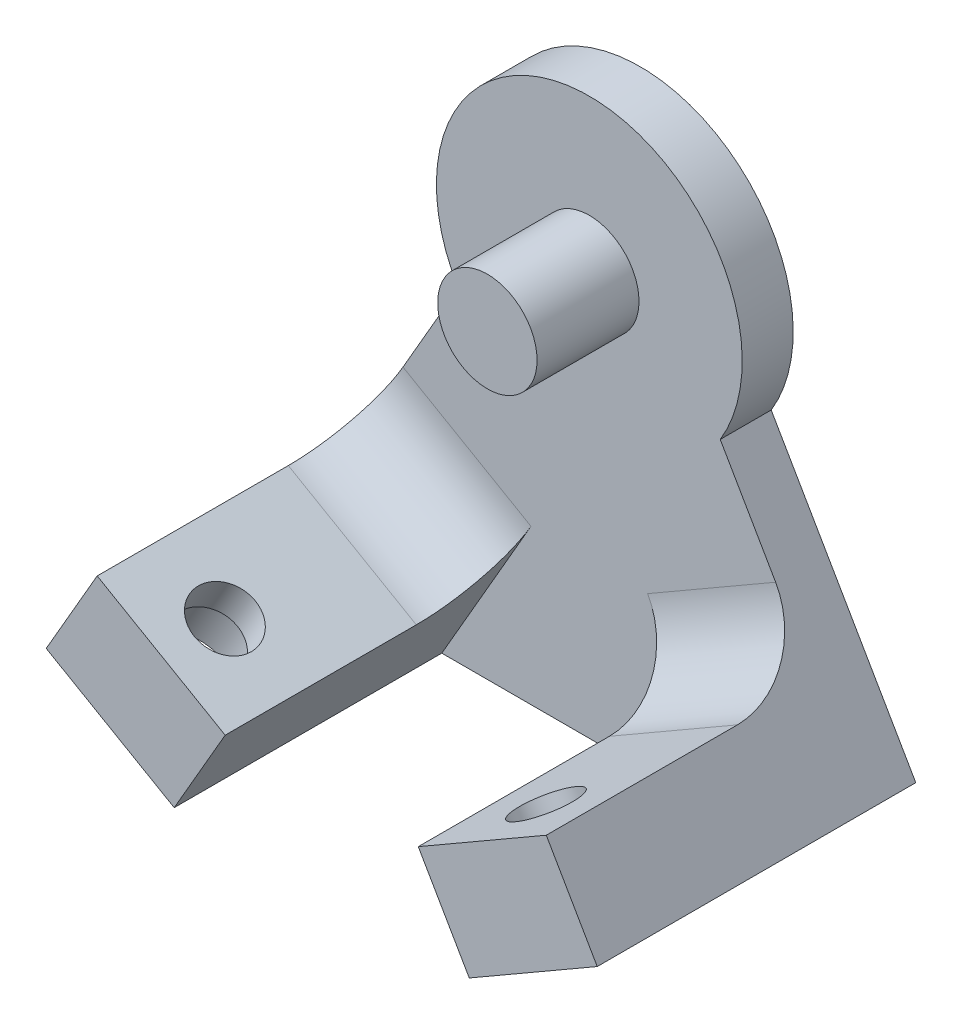
ISO-10303-21;
HEADER;
FILE_DESCRIPTION(('STEP AP214'),'2;1');
FILE_NAME('part.step','',(''),(''),'','','');
FILE_SCHEMA(('AUTOMOTIVE_DESIGN { 1 0 10303 214 1 1 1 1 }'));
ENDSEC;
DATA;
#1=APPLICATION_CONTEXT('core data for automotive mechanical design processes');
#2=APPLICATION_PROTOCOL_DEFINITION('international standard','automotive_design',2000,#1);
#3=PRODUCT_CONTEXT('',#1,'mechanical');
#4=PRODUCT('Part','Part','',(#3));
#5=PRODUCT_RELATED_PRODUCT_CATEGORY('part','',(#4));
#6=PRODUCT_DEFINITION_FORMATION('','',#4);
#7=PRODUCT_DEFINITION_CONTEXT('part definition',#1,'design');
#8=PRODUCT_DEFINITION('design','',#6,#7);
#9=PRODUCT_DEFINITION_SHAPE('','',#8);
#10=(LENGTH_UNIT() NAMED_UNIT(*) SI_UNIT(.MILLI.,.METRE.));
#11=(NAMED_UNIT(*) PLANE_ANGLE_UNIT() SI_UNIT($,.RADIAN.));
#12=(NAMED_UNIT(*) SI_UNIT($,.STERADIAN.) SOLID_ANGLE_UNIT());
#13=UNCERTAINTY_MEASURE_WITH_UNIT(LENGTH_MEASURE(1.E-05),#10,'distance_accuracy_value','');
#14=(GEOMETRIC_REPRESENTATION_CONTEXT(3) GLOBAL_UNCERTAINTY_ASSIGNED_CONTEXT((#13)) GLOBAL_UNIT_ASSIGNED_CONTEXT((#10,
#11,#12)) REPRESENTATION_CONTEXT('',''));
#15=CARTESIAN_POINT('',(0.,0.,0.));
#16=DIRECTION('',(0.,0.,1.));
#17=DIRECTION('',(1.,0.,0.));
#18=AXIS2_PLACEMENT_3D('',#15,#16,#17);
#19=CARTESIAN_POINT('',(-5.30094462909705,9.18150542570543,10.));
#20=DIRECTION('',(0.500000000000001,-0.866025403784438,0.));
#21=DIRECTION('',(0.866025403784438,0.500000000000001,0.));
#22=AXIS2_PLACEMENT_3D('',#19,#20,#21);
#23=CYLINDRICAL_SURFACE('',#22,1.2);
#24=CARTESIAN_POINT('',(6.30000000000001,-10.9119200876839,10.));
#25=DIRECTION('',(0.500000000000001,-0.866025403784438,0.));
#26=DIRECTION('',(0.866025403784438,0.500000000000001,0.));
#27=AXIS2_PLACEMENT_3D('',#24,#25,#26);
#28=CIRCLE('',#27,1.2);
#29=CARTESIAN_POINT('',(7.33923048454134,-10.3119200876839,10.));
#30=VERTEX_POINT('',#29);
#31=EDGE_CURVE('E249',#30,#30,#28,.F.);
#32=ORIENTED_EDGE('',*,*,#31,.T.);
#33=EDGE_LOOP('',(#32));
#34=FACE_BOUND('',#33,.T.);
#35=CARTESIAN_POINT('',(7.00000000000001,-12.1243556529821,10.));
#36=DIRECTION('',(0.500000000000001,-0.866025403784438,0.));
#37=DIRECTION('',(0.866025403784438,0.500000000000001,0.));
#38=AXIS2_PLACEMENT_3D('',#35,#36,#37);
#39=CIRCLE('',#38,1.2);
#40=CARTESIAN_POINT('',(8.03923048454134,-11.5243556529821,10.));
#41=VERTEX_POINT('',#40);
#42=EDGE_CURVE('E37',#41,#41,#39,.T.);
#43=ORIENTED_EDGE('',*,*,#42,.T.);
#44=EDGE_LOOP('',(#43));
#45=FACE_BOUND('',#44,.T.);
#46=ADVANCED_FACE('F33',(#34,#45),#23,.F.);
#47=CARTESIAN_POINT('',(5.30094462909705,9.18150542570543,10.));
#48=DIRECTION('',(-0.500000000000001,-0.866025403784438,0.));
#49=DIRECTION('',(0.866025403784438,-0.500000000000001,0.));
#50=AXIS2_PLACEMENT_3D('',#47,#48,#49);
#51=CYLINDRICAL_SURFACE('',#50,1.2);
#52=CARTESIAN_POINT('',(-6.30000000000001,-10.9119200876839,10.));
#53=DIRECTION('',(-0.500000000000001,-0.866025403784438,0.));
#54=DIRECTION('',(0.866025403784438,-0.500000000000001,0.));
#55=AXIS2_PLACEMENT_3D('',#52,#53,#54);
#56=CIRCLE('',#55,1.2);
#57=CARTESIAN_POINT('',(-5.26076951545868,-11.5119200876839,10.));
#58=VERTEX_POINT('',#57);
#59=EDGE_CURVE('E243',#58,#58,#56,.T.);
#60=ORIENTED_EDGE('',*,*,#59,.F.);
#61=EDGE_LOOP('',(#60));
#62=FACE_BOUND('',#61,.T.);
#63=CARTESIAN_POINT('',(-7.00000000000001,-12.1243556529821,10.));
#64=DIRECTION('',(-0.500000000000001,-0.866025403784438,0.));
#65=DIRECTION('',(0.866025403784438,-0.500000000000001,0.));
#66=AXIS2_PLACEMENT_3D('',#63,#64,#65);
#67=CIRCLE('',#66,1.2);
#68=CARTESIAN_POINT('',(-5.96076951545869,-12.7243556529821,10.));
#69=VERTEX_POINT('',#68);
#70=EDGE_CURVE('E246',#69,#69,#67,.F.);
#71=ORIENTED_EDGE('',*,*,#70,.F.);
#72=EDGE_LOOP('',(#71));
#73=FACE_BOUND('',#72,.T.);
#74=ADVANCED_FACE('F281',(#62,#73),#51,.F.);
#75=CARTESIAN_POINT('',(0.,0.,2.));
#76=DIRECTION('',(0.,0.,1.));
#77=DIRECTION('',(1.,0.,0.));
#78=AXIS2_PLACEMENT_3D('',#75,#76,#77);
#79=PLANE('',#78);
#80=CARTESIAN_POINT('',(0.,0.,2.));
#81=DIRECTION('',(0.,0.,1.));
#82=DIRECTION('',(1.,0.,0.));
#83=AXIS2_PLACEMENT_3D('',#80,#81,#82);
#84=CIRCLE('',#83,1.95);
#85=CARTESIAN_POINT('',(1.95,0.,2.));
#86=VERTEX_POINT('',#85);
#87=EDGE_CURVE('E161',#86,#86,#84,.T.);
#88=ORIENTED_EDGE('',*,*,#87,.F.);
#89=EDGE_LOOP('',(#88));
#90=FACE_BOUND('',#89,.T.);
#91=DIRECTION('',(0.500000000000001,-0.866025403784438,0.));
#92=VECTOR('',#91,1.);
#93=CARTESIAN_POINT('',(5.78852632902514,-15.8260217028217,2.));
#94=LINE('',#93,#92);
#95=CARTESIAN_POINT('',(2.28852632902514,-9.7638438763306,2.));
#96=VERTEX_POINT('',#95);
#97=CARTESIAN_POINT('',(5.78852632902514,-15.8260217028217,2.));
#98=VERTEX_POINT('',#97);
#99=EDGE_CURVE('E156',#96,#98,#94,.T.);
#100=ORIENTED_EDGE('',*,*,#99,.F.);
#101=DIRECTION('',(-0.866025403784438,-0.500000000000001,0.));
#102=VECTOR('',#101,1.);
#103=CARTESIAN_POINT('',(4.80000000000001,-8.3138438763306,2.));
#104=LINE('',#103,#102);
#105=CARTESIAN_POINT('',(7.31147367097488,-6.8638438763306,2.));
#106=VERTEX_POINT('',#105);
#107=EDGE_CURVE('E233',#96,#106,#104,.F.);
#108=ORIENTED_EDGE('',*,*,#107,.T.);
#109=DIRECTION('',(-0.500000000000001,0.866025403784438,0.));
#110=VECTOR('',#109,1.);
#111=CARTESIAN_POINT('',(8.81147367097488,-9.46192008768392,2.));
#112=LINE('',#111,#110);
#113=CARTESIAN_POINT('',(5.13778286830866,-3.09890096616753,2.));
#114=VERTEX_POINT('',#113);
#115=EDGE_CURVE('E203',#106,#114,#112,.T.);
#116=ORIENTED_EDGE('',*,*,#115,.T.);
#117=CARTESIAN_POINT('',(0.,0.,2.));
#118=DIRECTION('',(0.,0.,1.));
#119=DIRECTION('',(1.,0.,0.));
#120=AXIS2_PLACEMENT_3D('',#117,#118,#119);
#121=CIRCLE('',#120,6.);
#122=CARTESIAN_POINT('',(-5.13778286830866,-3.09890096616753,2.));
#123=VERTEX_POINT('',#122);
#124=EDGE_CURVE('E193',#114,#123,#121,.T.);
#125=ORIENTED_EDGE('',*,*,#124,.T.);
#126=DIRECTION('',(-0.5,-0.866025403784438,0.));
#127=VECTOR('',#126,1.);
#128=CARTESIAN_POINT('',(-8.81147367097488,-9.46192008768392,2.));
#129=LINE('',#128,#127);
#130=CARTESIAN_POINT('',(-7.31147367097488,-6.8638438763306,2.));
#131=VERTEX_POINT('',#130);
#132=EDGE_CURVE('E196',#123,#131,#129,.T.);
#133=ORIENTED_EDGE('',*,*,#132,.T.);
#134=DIRECTION('',(-0.866025403784438,0.500000000000001,0.));
#135=VECTOR('',#134,1.);
#136=CARTESIAN_POINT('',(-4.80000000000001,-8.31384387633061,2.));
#137=LINE('',#136,#135);
#138=CARTESIAN_POINT('',(-2.28852632902514,-9.7638438763306,2.));
#139=VERTEX_POINT('',#138);
#140=EDGE_CURVE('E230',#131,#139,#137,.F.);
#141=ORIENTED_EDGE('',*,*,#140,.T.);
#142=DIRECTION('',(0.500000000000001,0.866025403784438,0.));
#143=VECTOR('',#142,1.);
#144=CARTESIAN_POINT('',(-5.78852632902514,-15.8260217028217,2.));
#145=LINE('',#144,#143);
#146=CARTESIAN_POINT('',(-5.78852632902514,-15.8260217028217,2.));
#147=VERTEX_POINT('',#146);
#148=EDGE_CURVE('E172',#147,#139,#145,.T.);
#149=ORIENTED_EDGE('',*,*,#148,.F.);
#150=DIRECTION('',(1.,0.,0.));
#151=VECTOR('',#150,1.);
#152=CARTESIAN_POINT('',(-5.78852632902514,-15.8260217028217,2.));
#153=LINE('',#152,#151);
#154=EDGE_CURVE('E200',#147,#98,#153,.T.);
#155=ORIENTED_EDGE('',*,*,#154,.T.);
#156=EDGE_LOOP('',(#100,#108,#116,#125,#133,#141,#149,#155));
#157=FACE_BOUND('',#156,.T.);
#158=ADVANCED_FACE('F277',(#90,#157),#79,.T.);
#159=CARTESIAN_POINT('',(0.,0.,2.));
#160=DIRECTION('',(0.,0.,-1.));
#161=DIRECTION('',(-1.,0.,0.));
#162=AXIS2_PLACEMENT_3D('',#159,#160,#161);
#163=CYLINDRICAL_SURFACE('',#162,6.);
#164=CARTESIAN_POINT('',(0.,0.,0.));
#165=DIRECTION('',(0.,0.,1.));
#166=DIRECTION('',(1.,0.,0.));
#167=AXIS2_PLACEMENT_3D('',#164,#165,#166);
#168=CIRCLE('',#167,6.);
#169=CARTESIAN_POINT('',(5.13778286830866,-3.09890096616753,0.));
#170=VERTEX_POINT('',#169);
#171=CARTESIAN_POINT('',(-5.13778286830866,-3.09890096616753,0.));
#172=VERTEX_POINT('',#171);
#173=EDGE_CURVE('E192',#170,#172,#168,.T.);
#174=ORIENTED_EDGE('',*,*,#173,.T.);
#175=DIRECTION('',(0.,0.,-1.));
#176=VECTOR('',#175,1.);
#177=CARTESIAN_POINT('',(-5.13778286830866,-3.09890096616753,2.));
#178=LINE('',#177,#176);
#179=EDGE_CURVE('E224',#123,#172,#178,.T.);
#180=ORIENTED_EDGE('',*,*,#179,.F.);
#181=ORIENTED_EDGE('',*,*,#124,.F.);
#182=DIRECTION('',(0.,0.,-1.));
#183=VECTOR('',#182,1.);
#184=CARTESIAN_POINT('',(5.13778286830866,-3.09890096616753,2.));
#185=LINE('',#184,#183);
#186=EDGE_CURVE('E141',#114,#170,#185,.T.);
#187=ORIENTED_EDGE('',*,*,#186,.T.);
#188=EDGE_LOOP('',(#174,#180,#181,#187));
#189=FACE_BOUND('',#188,.T.);
#190=ADVANCED_FACE('F280',(#189),#163,.T.);
#191=CARTESIAN_POINT('',(-8.81147367097488,-9.46192008768392,2.));
#192=DIRECTION('',(0.866025403784438,-0.500000000000001,0.));
#193=DIRECTION('',(0.500000000000001,0.866025403784438,0.));
#194=AXIS2_PLACEMENT_3D('',#191,#192,#193);
#195=PLANE('',#194);
#196=DIRECTION('',(-0.500000000000001,-0.866025403784438,0.));
#197=VECTOR('',#196,1.);
#198=CARTESIAN_POINT('',(-8.81147367097488,-9.46192008768392,0.));
#199=LINE('',#198,#197);
#200=CARTESIAN_POINT('',(-10.8114736709749,-12.9260217028217,0.));
#201=VERTEX_POINT('',#200);
#202=EDGE_CURVE('E207',#172,#201,#199,.T.);
#203=ORIENTED_EDGE('',*,*,#202,.T.);
#204=DIRECTION('',(0.,0.,-1.));
#205=VECTOR('',#204,1.);
#206=CARTESIAN_POINT('',(-10.8114736709749,-12.9260217028217,2.));
#207=LINE('',#206,#205);
#208=CARTESIAN_POINT('',(-10.8114736709749,-12.9260217028217,12.5));
#209=VERTEX_POINT('',#208);
#210=EDGE_CURVE('E221',#209,#201,#207,.T.);
#211=ORIENTED_EDGE('',*,*,#210,.F.);
#212=DIRECTION('',(-0.500000000000001,-0.866025403784438,0.));
#213=VECTOR('',#212,1.);
#214=CARTESIAN_POINT('',(-10.8114736709749,-12.9260217028217,12.5));
#215=LINE('',#214,#213);
#216=CARTESIAN_POINT('',(-8.81147367097488,-9.46192008768392,12.5));
#217=VERTEX_POINT('',#216);
#218=EDGE_CURVE('E178',#217,#209,#215,.T.);
#219=ORIENTED_EDGE('',*,*,#218,.F.);
#220=DIRECTION('',(0.,0.,-1.));
#221=VECTOR('',#220,1.);
#222=CARTESIAN_POINT('',(-8.81147367097488,-9.46192008768392,12.5));
#223=LINE('',#222,#221);
#224=CARTESIAN_POINT('',(-8.81147367097488,-9.46192008768392,5.));
#225=VERTEX_POINT('',#224);
#226=EDGE_CURVE('E187',#217,#225,#223,.T.);
#227=ORIENTED_EDGE('',*,*,#226,.T.);
#228=CARTESIAN_POINT('',(-7.31147367097488,-6.8638438763306,5.));
#229=DIRECTION('',(0.866025403784438,-0.500000000000001,0.));
#230=DIRECTION('',(0.500000000000001,0.866025403784438,0.));
#231=AXIS2_PLACEMENT_3D('',#228,#229,#230);
#232=CIRCLE('',#231,3.);
#233=EDGE_CURVE('E42',#225,#131,#232,.T.);
#234=ORIENTED_EDGE('',*,*,#233,.T.);
#235=ORIENTED_EDGE('',*,*,#132,.F.);
#236=ORIENTED_EDGE('',*,*,#179,.T.);
#237=EDGE_LOOP('',(#203,#211,#219,#227,#234,#235,#236));
#238=FACE_BOUND('',#237,.T.);
#239=ADVANCED_FACE('F311',(#238),#195,.F.);
#240=CARTESIAN_POINT('',(-10.8114736709749,-12.9260217028217,2.));
#241=DIRECTION('',(0.500000000000001,0.866025403784438,0.));
#242=DIRECTION('',(-0.866025403784438,0.500000000000001,0.));
#243=AXIS2_PLACEMENT_3D('',#240,#241,#242);
#244=PLANE('',#243);
#245=CARTESIAN_POINT('',(-8.30000000000001,-14.3760217028217,10.));
#246=DIRECTION('',(-0.500000000000001,-0.866025403784438,0.));
#247=DIRECTION('',(0.866025403784438,-0.500000000000001,0.));
#248=AXIS2_PLACEMENT_3D('',#245,#246,#247);
#249=CIRCLE('',#248,2.);
#250=CARTESIAN_POINT('',(-6.56794919243114,-15.3760217028217,10.));
#251=VERTEX_POINT('',#250);
#252=EDGE_CURVE('E251',#251,#251,#249,.T.);
#253=ORIENTED_EDGE('',*,*,#252,.F.);
#254=EDGE_LOOP('',(#253));
#255=FACE_BOUND('',#254,.T.);
#256=DIRECTION('',(0.866025403784438,-0.500000000000001,0.));
#257=VECTOR('',#256,1.);
#258=CARTESIAN_POINT('',(-10.8114736709749,-12.9260217028217,0.));
#259=LINE('',#258,#257);
#260=CARTESIAN_POINT('',(-5.78852632902514,-15.8260217028217,0.));
#261=VERTEX_POINT('',#260);
#262=EDGE_CURVE('E209',#201,#261,#259,.T.);
#263=ORIENTED_EDGE('',*,*,#262,.T.);
#264=DIRECTION('',(0.,0.,-1.));
#265=VECTOR('',#264,1.);
#266=CARTESIAN_POINT('',(-5.78852632902514,-15.8260217028217,2.));
#267=LINE('',#266,#265);
#268=EDGE_CURVE('E218',#147,#261,#267,.T.);
#269=ORIENTED_EDGE('',*,*,#268,.F.);
#270=DIRECTION('',(0.,0.,-1.));
#271=VECTOR('',#270,1.);
#272=CARTESIAN_POINT('',(-5.78852632902514,-15.8260217028217,12.5));
#273=LINE('',#272,#271);
#274=CARTESIAN_POINT('',(-5.78852632902514,-15.8260217028217,12.5));
#275=VERTEX_POINT('',#274);
#276=EDGE_CURVE('E183',#275,#147,#273,.T.);
#277=ORIENTED_EDGE('',*,*,#276,.F.);
#278=DIRECTION('',(0.866025403784438,-0.500000000000001,0.));
#279=VECTOR('',#278,1.);
#280=CARTESIAN_POINT('',(-5.78852632902514,-15.8260217028217,12.5));
#281=LINE('',#280,#279);
#282=EDGE_CURVE('E181',#209,#275,#281,.T.);
#283=ORIENTED_EDGE('',*,*,#282,.F.);
#284=ORIENTED_EDGE('',*,*,#210,.T.);
#285=EDGE_LOOP('',(#263,#269,#277,#283,#284));
#286=FACE_BOUND('',#285,.T.);
#287=ADVANCED_FACE('F317',(#255,#286),#244,.F.);
#288=CARTESIAN_POINT('',(-5.78852632902514,-15.8260217028217,2.));
#289=DIRECTION('',(0.,1.,0.));
#290=DIRECTION('',(0.,0.,1.));
#291=AXIS2_PLACEMENT_3D('',#288,#289,#290);
#292=PLANE('',#291);
#293=DIRECTION('',(1.,0.,0.));
#294=VECTOR('',#293,1.);
#295=CARTESIAN_POINT('',(-5.78852632902514,-15.8260217028217,0.));
#296=LINE('',#295,#294);
#297=CARTESIAN_POINT('',(5.78852632902514,-15.8260217028217,0.));
#298=VERTEX_POINT('',#297);
#299=EDGE_CURVE('E211',#261,#298,#296,.T.);
#300=ORIENTED_EDGE('',*,*,#299,.T.);
#301=DIRECTION('',(0.,0.,-1.));
#302=VECTOR('',#301,1.);
#303=CARTESIAN_POINT('',(5.78852632902514,-15.8260217028217,2.));
#304=LINE('',#303,#302);
#305=EDGE_CURVE('E140',#98,#298,#304,.T.);
#306=ORIENTED_EDGE('',*,*,#305,.F.);
#307=ORIENTED_EDGE('',*,*,#154,.F.);
#308=ORIENTED_EDGE('',*,*,#268,.T.);
#309=EDGE_LOOP('',(#300,#306,#307,#308));
#310=FACE_BOUND('',#309,.T.);
#311=ADVANCED_FACE('F483',(#310),#292,.F.);
#312=CARTESIAN_POINT('',(10.8114736709749,-12.9260217028217,2.));
#313=DIRECTION('',(-0.500000000000001,0.866025403784438,0.));
#314=DIRECTION('',(-0.866025403784438,-0.500000000000001,0.));
#315=AXIS2_PLACEMENT_3D('',#312,#313,#314);
#316=PLANE('',#315);
#317=CARTESIAN_POINT('',(8.30000000000001,-14.3760217028217,10.));
#318=DIRECTION('',(-0.500000000000001,0.866025403784438,0.));
#319=DIRECTION('',(-0.866025403784438,-0.500000000000001,0.));
#320=AXIS2_PLACEMENT_3D('',#317,#318,#319);
#321=CIRCLE('',#320,2.);
#322=CARTESIAN_POINT('',(6.56794919243114,-15.3760217028217,10.));
#323=VERTEX_POINT('',#322);
#324=EDGE_CURVE('E261',#323,#323,#321,.T.);
#325=ORIENTED_EDGE('',*,*,#324,.T.);
#326=EDGE_LOOP('',(#325));
#327=FACE_BOUND('',#326,.T.);
#328=DIRECTION('',(0.866025403784438,0.500000000000001,0.));
#329=VECTOR('',#328,1.);
#330=CARTESIAN_POINT('',(10.8114736709749,-12.9260217028217,0.));
#331=LINE('',#330,#329);
#332=CARTESIAN_POINT('',(10.8114736709749,-12.9260217028217,0.));
#333=VERTEX_POINT('',#332);
#334=EDGE_CURVE('E138',#298,#333,#331,.T.);
#335=ORIENTED_EDGE('',*,*,#334,.T.);
#336=DIRECTION('',(0.,0.,-1.));
#337=VECTOR('',#336,1.);
#338=CARTESIAN_POINT('',(10.8114736709749,-12.9260217028217,2.));
#339=LINE('',#338,#337);
#340=CARTESIAN_POINT('',(10.8114736709749,-12.9260217028217,12.5));
#341=VERTEX_POINT('',#340);
#342=EDGE_CURVE('E130',#341,#333,#339,.T.);
#343=ORIENTED_EDGE('',*,*,#342,.F.);
#344=DIRECTION('',(0.866025403784438,0.500000000000001,0.));
#345=VECTOR('',#344,1.);
#346=CARTESIAN_POINT('',(5.78852632902514,-15.8260217028217,12.5));
#347=LINE('',#346,#345);
#348=CARTESIAN_POINT('',(5.78852632902514,-15.8260217028217,12.5));
#349=VERTEX_POINT('',#348);
#350=EDGE_CURVE('E135',#349,#341,#347,.T.);
#351=ORIENTED_EDGE('',*,*,#350,.F.);
#352=DIRECTION('',(0.,0.,-1.));
#353=VECTOR('',#352,1.);
#354=CARTESIAN_POINT('',(5.78852632902514,-15.8260217028217,12.5));
#355=LINE('',#354,#353);
#356=EDGE_CURVE('E165',#349,#98,#355,.T.);
#357=ORIENTED_EDGE('',*,*,#356,.T.);
#358=ORIENTED_EDGE('',*,*,#305,.T.);
#359=EDGE_LOOP('',(#335,#343,#351,#357,#358));
#360=FACE_BOUND('',#359,.T.);
#361=ADVANCED_FACE('F132',(#327,#360),#316,.F.);
#362=CARTESIAN_POINT('',(8.81147367097488,-9.46192008768392,2.));
#363=DIRECTION('',(-0.866025403784438,-0.5,0.));
#364=DIRECTION('',(0.5,-0.866025403784438,0.));
#365=AXIS2_PLACEMENT_3D('',#362,#363,#364);
#366=PLANE('',#365);
#367=DIRECTION('',(-0.5,0.866025403784438,0.));
#368=VECTOR('',#367,1.);
#369=CARTESIAN_POINT('',(8.81147367097488,-9.46192008768392,0.));
#370=LINE('',#369,#368);
#371=EDGE_CURVE('E197',#333,#170,#370,.T.);
#372=ORIENTED_EDGE('',*,*,#371,.T.);
#373=ORIENTED_EDGE('',*,*,#186,.F.);
#374=ORIENTED_EDGE('',*,*,#115,.F.);
#375=CARTESIAN_POINT('',(7.31147367097488,-6.8638438763306,5.));
#376=DIRECTION('',(-0.866025403784438,-0.5,0.));
#377=DIRECTION('',(0.5,-0.866025403784438,0.));
#378=AXIS2_PLACEMENT_3D('',#375,#376,#377);
#379=CIRCLE('',#378,3.);
#380=CARTESIAN_POINT('',(8.81147367097488,-9.46192008768392,5.));
#381=VERTEX_POINT('',#380);
#382=EDGE_CURVE('E240',#106,#381,#379,.T.);
#383=ORIENTED_EDGE('',*,*,#382,.T.);
#384=DIRECTION('',(0.,0.,-1.));
#385=VECTOR('',#384,1.);
#386=CARTESIAN_POINT('',(8.81147367097488,-9.46192008768392,12.5));
#387=LINE('',#386,#385);
#388=CARTESIAN_POINT('',(8.81147367097488,-9.46192008768392,12.5));
#389=VERTEX_POINT('',#388);
#390=EDGE_CURVE('E147',#389,#381,#387,.T.);
#391=ORIENTED_EDGE('',*,*,#390,.F.);
#392=DIRECTION('',(-0.500000000000001,0.866025403784438,0.));
#393=VECTOR('',#392,1.);
#394=CARTESIAN_POINT('',(10.8114736709749,-12.9260217028217,12.5));
#395=LINE('',#394,#393);
#396=EDGE_CURVE('E144',#341,#389,#395,.T.);
#397=ORIENTED_EDGE('',*,*,#396,.F.);
#398=ORIENTED_EDGE('',*,*,#342,.T.);
#399=EDGE_LOOP('',(#372,#373,#374,#383,#391,#397,#398));
#400=FACE_BOUND('',#399,.T.);
#401=ADVANCED_FACE('F145',(#400),#366,.F.);
#402=CARTESIAN_POINT('',(0.,0.,0.));
#403=DIRECTION('',(0.,0.,1.));
#404=DIRECTION('',(1.,0.,0.));
#405=AXIS2_PLACEMENT_3D('',#402,#403,#404);
#406=PLANE('',#405);
#407=ORIENTED_EDGE('',*,*,#173,.F.);
#408=ORIENTED_EDGE('',*,*,#371,.F.);
#409=ORIENTED_EDGE('',*,*,#334,.F.);
#410=ORIENTED_EDGE('',*,*,#299,.F.);
#411=ORIENTED_EDGE('',*,*,#262,.F.);
#412=ORIENTED_EDGE('',*,*,#202,.F.);
#413=EDGE_LOOP('',(#407,#408,#409,#410,#411,#412));
#414=FACE_BOUND('',#413,.T.);
#415=ADVANCED_FACE('F301',(#414),#406,.F.);
#416=CARTESIAN_POINT('',(-5.78852632902514,-15.8260217028217,12.5));
#417=DIRECTION('',(-0.866025403784438,0.500000000000001,0.));
#418=DIRECTION('',(-0.500000000000001,-0.866025403784438,0.));
#419=AXIS2_PLACEMENT_3D('',#416,#417,#418);
#420=PLANE('',#419);
#421=ORIENTED_EDGE('',*,*,#148,.T.);
#422=CARTESIAN_POINT('',(-2.28852632902514,-9.7638438763306,5.));
#423=DIRECTION('',(-0.866025403784438,0.500000000000001,0.));
#424=DIRECTION('',(-0.500000000000001,-0.866025403784438,0.));
#425=AXIS2_PLACEMENT_3D('',#422,#423,#424);
#426=CIRCLE('',#425,3.);
#427=CARTESIAN_POINT('',(-3.78852632902514,-12.3619200876839,5.));
#428=VERTEX_POINT('',#427);
#429=EDGE_CURVE('E11',#139,#428,#426,.T.);
#430=ORIENTED_EDGE('',*,*,#429,.T.);
#431=DIRECTION('',(0.,0.,-1.));
#432=VECTOR('',#431,1.);
#433=CARTESIAN_POINT('',(-3.78852632902514,-12.3619200876839,12.5));
#434=LINE('',#433,#432);
#435=CARTESIAN_POINT('',(-3.78852632902514,-12.3619200876839,12.5));
#436=VERTEX_POINT('',#435);
#437=EDGE_CURVE('E190',#436,#428,#434,.T.);
#438=ORIENTED_EDGE('',*,*,#437,.F.);
#439=DIRECTION('',(0.500000000000001,0.866025403784438,0.));
#440=VECTOR('',#439,1.);
#441=CARTESIAN_POINT('',(-5.78852632902514,-15.8260217028217,12.5));
#442=LINE('',#441,#440);
#443=EDGE_CURVE('E173',#275,#436,#442,.T.);
#444=ORIENTED_EDGE('',*,*,#443,.F.);
#445=ORIENTED_EDGE('',*,*,#276,.T.);
#446=EDGE_LOOP('',(#421,#430,#438,#444,#445));
#447=FACE_BOUND('',#446,.T.);
#448=ADVANCED_FACE('F320',(#447),#420,.F.);
#449=CARTESIAN_POINT('',(-3.78852632902514,-12.3619200876839,12.5));
#450=DIRECTION('',(-0.500000000000001,-0.866025403784438,0.));
#451=DIRECTION('',(0.866025403784438,-0.500000000000001,0.));
#452=AXIS2_PLACEMENT_3D('',#449,#450,#451);
#453=PLANE('',#452);
#454=ORIENTED_EDGE('',*,*,#59,.T.);
#455=EDGE_LOOP('',(#454));
#456=FACE_BOUND('',#455,.T.);
#457=ORIENTED_EDGE('',*,*,#437,.T.);
#458=DIRECTION('',(-0.866025403784438,0.500000000000001,0.));
#459=VECTOR('',#458,1.);
#460=CARTESIAN_POINT('',(-3.78852632902514,-12.3619200876839,5.));
#461=LINE('',#460,#459);
#462=EDGE_CURVE('E235',#428,#225,#461,.T.);
#463=ORIENTED_EDGE('',*,*,#462,.T.);
#464=ORIENTED_EDGE('',*,*,#226,.F.);
#465=DIRECTION('',(-0.866025403784438,0.500000000000001,0.));
#466=VECTOR('',#465,1.);
#467=CARTESIAN_POINT('',(-3.78852632902514,-12.3619200876839,12.5));
#468=LINE('',#467,#466);
#469=EDGE_CURVE('E176',#436,#217,#468,.T.);
#470=ORIENTED_EDGE('',*,*,#469,.F.);
#471=EDGE_LOOP('',(#457,#463,#464,#470));
#472=FACE_BOUND('',#471,.T.);
#473=ADVANCED_FACE('F309',(#456,#472),#453,.F.);
#474=CARTESIAN_POINT('',(0.,0.,12.5));
#475=DIRECTION('',(0.,0.,1.));
#476=DIRECTION('',(1.,0.,0.));
#477=AXIS2_PLACEMENT_3D('',#474,#475,#476);
#478=PLANE('',#477);
#479=ORIENTED_EDGE('',*,*,#443,.T.);
#480=ORIENTED_EDGE('',*,*,#469,.T.);
#481=ORIENTED_EDGE('',*,*,#218,.T.);
#482=ORIENTED_EDGE('',*,*,#282,.T.);
#483=EDGE_LOOP('',(#479,#480,#481,#482));
#484=FACE_BOUND('',#483,.T.);
#485=ADVANCED_FACE('F314',(#484),#478,.T.);
#486=CARTESIAN_POINT('',(3.78852632902514,-12.3619200876839,12.5));
#487=DIRECTION('',(0.500000000000001,-0.866025403784438,0.));
#488=DIRECTION('',(0.866025403784438,0.500000000000001,0.));
#489=AXIS2_PLACEMENT_3D('',#486,#487,#488);
#490=PLANE('',#489);
#491=ORIENTED_EDGE('',*,*,#31,.F.);
#492=EDGE_LOOP('',(#491));
#493=FACE_BOUND('',#492,.T.);
#494=ORIENTED_EDGE('',*,*,#390,.T.);
#495=DIRECTION('',(-0.866025403784438,-0.500000000000001,0.));
#496=VECTOR('',#495,1.);
#497=CARTESIAN_POINT('',(3.78852632902514,-12.3619200876839,5.));
#498=LINE('',#497,#496);
#499=CARTESIAN_POINT('',(3.78852632902514,-12.3619200876839,5.));
#500=VERTEX_POINT('',#499);
#501=EDGE_CURVE('E227',#381,#500,#498,.T.);
#502=ORIENTED_EDGE('',*,*,#501,.T.);
#503=DIRECTION('',(0.,0.,-1.));
#504=VECTOR('',#503,1.);
#505=CARTESIAN_POINT('',(3.78852632902514,-12.3619200876839,12.5));
#506=LINE('',#505,#504);
#507=CARTESIAN_POINT('',(3.78852632902514,-12.3619200876839,12.5));
#508=VERTEX_POINT('',#507);
#509=EDGE_CURVE('E168',#508,#500,#506,.T.);
#510=ORIENTED_EDGE('',*,*,#509,.F.);
#511=DIRECTION('',(-0.866025403784438,-0.500000000000001,0.));
#512=VECTOR('',#511,1.);
#513=CARTESIAN_POINT('',(3.78852632902514,-12.3619200876839,12.5));
#514=LINE('',#513,#512);
#515=EDGE_CURVE('E150',#389,#508,#514,.T.);
#516=ORIENTED_EDGE('',*,*,#515,.F.);
#517=EDGE_LOOP('',(#494,#502,#510,#516));
#518=FACE_BOUND('',#517,.T.);
#519=ADVANCED_FACE('F296',(#493,#518),#490,.F.);
#520=CARTESIAN_POINT('',(5.78852632902514,-15.8260217028217,12.5));
#521=DIRECTION('',(0.866025403784438,0.500000000000001,0.));
#522=DIRECTION('',(-0.500000000000001,0.866025403784438,0.));
#523=AXIS2_PLACEMENT_3D('',#520,#521,#522);
#524=PLANE('',#523);
#525=ORIENTED_EDGE('',*,*,#99,.T.);
#526=ORIENTED_EDGE('',*,*,#356,.F.);
#527=DIRECTION('',(0.500000000000001,-0.866025403784438,0.));
#528=VECTOR('',#527,1.);
#529=CARTESIAN_POINT('',(5.78852632902514,-15.8260217028217,12.5));
#530=LINE('',#529,#528);
#531=EDGE_CURVE('E154',#508,#349,#530,.T.);
#532=ORIENTED_EDGE('',*,*,#531,.F.);
#533=ORIENTED_EDGE('',*,*,#509,.T.);
#534=CARTESIAN_POINT('',(2.28852632902514,-9.7638438763306,5.));
#535=DIRECTION('',(0.866025403784438,0.500000000000001,0.));
#536=DIRECTION('',(-0.500000000000001,0.866025403784438,0.));
#537=AXIS2_PLACEMENT_3D('',#534,#535,#536);
#538=CIRCLE('',#537,3.);
#539=EDGE_CURVE('E237',#500,#96,#538,.T.);
#540=ORIENTED_EDGE('',*,*,#539,.T.);
#541=EDGE_LOOP('',(#525,#526,#532,#533,#540));
#542=FACE_BOUND('',#541,.T.);
#543=ADVANCED_FACE('F288',(#542),#524,.F.);
#544=CARTESIAN_POINT('',(0.,0.,12.5));
#545=DIRECTION('',(0.,0.,1.));
#546=DIRECTION('',(1.,0.,0.));
#547=AXIS2_PLACEMENT_3D('',#544,#545,#546);
#548=PLANE('',#547);
#549=ORIENTED_EDGE('',*,*,#350,.T.);
#550=ORIENTED_EDGE('',*,*,#396,.T.);
#551=ORIENTED_EDGE('',*,*,#515,.T.);
#552=ORIENTED_EDGE('',*,*,#531,.T.);
#553=EDGE_LOOP('',(#549,#550,#551,#552));
#554=FACE_BOUND('',#553,.T.);
#555=ADVANCED_FACE('F152',(#554),#548,.T.);
#556=CARTESIAN_POINT('',(0.,0.,6.));
#557=DIRECTION('',(0.,0.,-1.));
#558=DIRECTION('',(-1.,0.,0.));
#559=AXIS2_PLACEMENT_3D('',#556,#557,#558);
#560=CYLINDRICAL_SURFACE('',#559,1.95);
#561=CARTESIAN_POINT('',(0.,0.,6.));
#562=DIRECTION('',(0.,0.,1.));
#563=DIRECTION('',(1.,0.,0.));
#564=AXIS2_PLACEMENT_3D('',#561,#562,#563);
#565=CIRCLE('',#564,1.95);
#566=CARTESIAN_POINT('',(1.95,0.,6.));
#567=VERTEX_POINT('',#566);
#568=EDGE_CURVE('E158',#567,#567,#565,.T.);
#569=ORIENTED_EDGE('',*,*,#568,.F.);
#570=EDGE_LOOP('',(#569));
#571=FACE_BOUND('',#570,.T.);
#572=ORIENTED_EDGE('',*,*,#87,.T.);
#573=EDGE_LOOP('',(#572));
#574=FACE_BOUND('',#573,.T.);
#575=ADVANCED_FACE('F275',(#571,#574),#560,.T.);
#576=CARTESIAN_POINT('',(0.,0.,6.));
#577=DIRECTION('',(0.,0.,1.));
#578=DIRECTION('',(1.,0.,0.));
#579=AXIS2_PLACEMENT_3D('',#576,#577,#578);
#580=PLANE('',#579);
#581=ORIENTED_EDGE('',*,*,#568,.T.);
#582=EDGE_LOOP('',(#581));
#583=FACE_BOUND('',#582,.T.);
#584=ADVANCED_FACE('F349',(#583),#580,.T.);
#585=CARTESIAN_POINT('',(2.28852632902514,-9.7638438763306,5.));
#586=DIRECTION('',(-0.866025403784438,-0.500000000000001,0.));
#587=DIRECTION('',(0.500000000000001,-0.866025403784438,0.));
#588=AXIS2_PLACEMENT_3D('',#585,#586,#587);
#589=CYLINDRICAL_SURFACE('',#588,3.);
#590=ORIENTED_EDGE('',*,*,#382,.F.);
#591=ORIENTED_EDGE('',*,*,#107,.F.);
#592=ORIENTED_EDGE('',*,*,#539,.F.);
#593=ORIENTED_EDGE('',*,*,#501,.F.);
#594=EDGE_LOOP('',(#590,#591,#592,#593));
#595=FACE_BOUND('',#594,.T.);
#596=ADVANCED_FACE('F293',(#595),#589,.F.);
#597=CARTESIAN_POINT('',(-2.28852632902514,-9.7638438763306,5.));
#598=DIRECTION('',(-0.866025403784438,0.500000000000001,0.));
#599=DIRECTION('',(-0.500000000000001,-0.866025403784438,0.));
#600=AXIS2_PLACEMENT_3D('',#597,#598,#599);
#601=CYLINDRICAL_SURFACE('',#600,3.);
#602=ORIENTED_EDGE('',*,*,#429,.F.);
#603=ORIENTED_EDGE('',*,*,#140,.F.);
#604=ORIENTED_EDGE('',*,*,#233,.F.);
#605=ORIENTED_EDGE('',*,*,#462,.F.);
#606=EDGE_LOOP('',(#602,#603,#604,#605));
#607=FACE_BOUND('',#606,.T.);
#608=ADVANCED_FACE('F35',(#607),#601,.F.);
#609=CARTESIAN_POINT('',(-7.00000000000001,-12.1243556529821,10.));
#610=DIRECTION('',(-0.500000000000001,-0.866025403784438,0.));
#611=DIRECTION('',(0.866025403784438,-0.500000000000001,0.));
#612=AXIS2_PLACEMENT_3D('',#609,#610,#611);
#613=PLANE('',#612);
#614=CARTESIAN_POINT('',(-7.00000000000001,-12.1243556529821,10.));
#615=DIRECTION('',(-0.500000000000001,-0.866025403784438,0.));
#616=DIRECTION('',(0.866025403784438,-0.500000000000001,0.));
#617=AXIS2_PLACEMENT_3D('',#614,#615,#616);
#618=CIRCLE('',#617,2.);
#619=CARTESIAN_POINT('',(-5.26794919243113,-13.1243556529821,10.));
#620=VERTEX_POINT('',#619);
#621=EDGE_CURVE('E248',#620,#620,#618,.T.);
#622=ORIENTED_EDGE('',*,*,#621,.T.);
#623=EDGE_LOOP('',(#622));
#624=FACE_BOUND('',#623,.T.);
#625=ORIENTED_EDGE('',*,*,#70,.T.);
#626=EDGE_LOOP('',(#625));
#627=FACE_BOUND('',#626,.T.);
#628=ADVANCED_FACE('F341',(#624,#627),#613,.T.);
#629=CARTESIAN_POINT('',(-7.00000000000001,-12.1243556529821,10.));
#630=DIRECTION('',(-0.500000000000001,-0.866025403784438,0.));
#631=DIRECTION('',(0.866025403784438,-0.500000000000001,0.));
#632=AXIS2_PLACEMENT_3D('',#629,#630,#631);
#633=CYLINDRICAL_SURFACE('',#632,2.);
#634=ORIENTED_EDGE('',*,*,#621,.F.);
#635=EDGE_LOOP('',(#634));
#636=FACE_BOUND('',#635,.T.);
#637=ORIENTED_EDGE('',*,*,#252,.T.);
#638=EDGE_LOOP('',(#637));
#639=FACE_BOUND('',#638,.T.);
#640=ADVANCED_FACE('F344',(#636,#639),#633,.F.);
#641=CARTESIAN_POINT('',(7.00000000000001,-12.1243556529821,10.));
#642=DIRECTION('',(0.500000000000001,-0.866025403784438,0.));
#643=DIRECTION('',(0.866025403784438,0.500000000000001,0.));
#644=AXIS2_PLACEMENT_3D('',#641,#642,#643);
#645=CYLINDRICAL_SURFACE('',#644,2.);
#646=CARTESIAN_POINT('',(7.00000000000001,-12.1243556529821,10.));
#647=DIRECTION('',(-0.500000000000001,0.866025403784438,0.));
#648=DIRECTION('',(-0.866025403784438,-0.500000000000001,0.));
#649=AXIS2_PLACEMENT_3D('',#646,#647,#648);
#650=CIRCLE('',#649,2.);
#651=CARTESIAN_POINT('',(5.26794919243113,-13.1243556529821,10.));
#652=VERTEX_POINT('',#651);
#653=EDGE_CURVE('E257',#652,#652,#650,.T.);
#654=ORIENTED_EDGE('',*,*,#653,.T.);
#655=EDGE_LOOP('',(#654));
#656=FACE_BOUND('',#655,.T.);
#657=ORIENTED_EDGE('',*,*,#324,.F.);
#658=EDGE_LOOP('',(#657));
#659=FACE_BOUND('',#658,.T.);
#660=ADVANCED_FACE('F339',(#656,#659),#645,.F.);
#661=CARTESIAN_POINT('',(7.00000000000001,-12.1243556529821,10.));
#662=DIRECTION('',(0.500000000000001,-0.866025403784438,0.));
#663=DIRECTION('',(-0.866025403784438,-0.500000000000001,0.));
#664=AXIS2_PLACEMENT_3D('',#661,#662,#663);
#665=PLANE('',#664);
#666=ORIENTED_EDGE('',*,*,#42,.F.);
#667=EDGE_LOOP('',(#666));
#668=FACE_BOUND('',#667,.T.);
#669=ORIENTED_EDGE('',*,*,#653,.F.);
#670=EDGE_LOOP('',(#669));
#671=FACE_BOUND('',#670,.T.);
#672=ADVANCED_FACE('F415',(#668,#671),#665,.T.);
#673=CLOSED_SHELL('',(#46,#74,#158,#190,#239,#287,#311,#361,#401,#415,#448,#473,#485,#519,#543,
#555,#575,#584,#596,#608,#628,#640,#660,#672));
#674=MANIFOLD_SOLID_BREP('B2',#673);
#675=ADVANCED_BREP_SHAPE_REPRESENTATION('',(#18,#674),#14);
#676=SHAPE_DEFINITION_REPRESENTATION(#9,#675);
ENDSEC;
END-ISO-10303-21;
